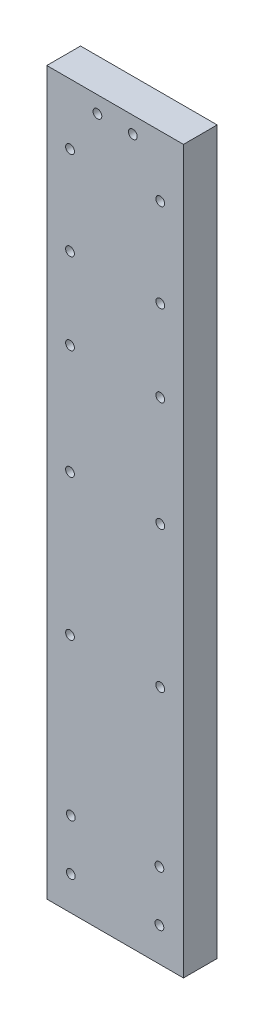
ISO-10303-21;
HEADER;
FILE_DESCRIPTION(('STEP AP214'),'2;1');
FILE_NAME('part.step','',(''),(''),'','','');
FILE_SCHEMA(('AUTOMOTIVE_DESIGN { 1 0 10303 214 1 1 1 1 }'));
ENDSEC;
DATA;
#1=APPLICATION_CONTEXT('core data for automotive mechanical design processes');
#2=APPLICATION_PROTOCOL_DEFINITION('international standard','automotive_design',2000,#1);
#3=PRODUCT_CONTEXT('',#1,'mechanical');
#4=PRODUCT('Part','Part','',(#3));
#5=PRODUCT_RELATED_PRODUCT_CATEGORY('part','',(#4));
#6=PRODUCT_DEFINITION_FORMATION('','',#4);
#7=PRODUCT_DEFINITION_CONTEXT('part definition',#1,'design');
#8=PRODUCT_DEFINITION('design','',#6,#7);
#9=PRODUCT_DEFINITION_SHAPE('','',#8);
#10=(LENGTH_UNIT() NAMED_UNIT(*) SI_UNIT(.MILLI.,.METRE.));
#11=(NAMED_UNIT(*) PLANE_ANGLE_UNIT() SI_UNIT($,.RADIAN.));
#12=(NAMED_UNIT(*) SI_UNIT($,.STERADIAN.) SOLID_ANGLE_UNIT());
#13=UNCERTAINTY_MEASURE_WITH_UNIT(LENGTH_MEASURE(1.E-05),#10,'distance_accuracy_value','');
#14=(GEOMETRIC_REPRESENTATION_CONTEXT(3) GLOBAL_UNCERTAINTY_ASSIGNED_CONTEXT((#13)) GLOBAL_UNIT_ASSIGNED_CONTEXT((#10,
#11,#12)) REPRESENTATION_CONTEXT('',''));
#15=CARTESIAN_POINT('',(0.,0.,0.));
#16=DIRECTION('',(0.,0.,1.));
#17=DIRECTION('',(1.,0.,0.));
#18=AXIS2_PLACEMENT_3D('',#15,#16,#17);
#19=CARTESIAN_POINT('',(0.,0.,4.));
#20=DIRECTION('',(0.,0.,-1.));
#21=DIRECTION('',(-1.,0.,0.));
#22=AXIS2_PLACEMENT_3D('',#19,#20,#21);
#23=PLANE('',#22);
#24=CARTESIAN_POINT('',(10.2,83.635,4.));
#25=DIRECTION('',(0.,0.,1.));
#26=DIRECTION('',(1.,0.,0.));
#27=AXIS2_PLACEMENT_3D('',#24,#25,#26);
#28=CIRCLE('',#27,0.519960121099865);
#29=CARTESIAN_POINT('',(10.7199601210999,83.635,4.));
#30=VERTEX_POINT('',#29);
#31=EDGE_CURVE('E193',#30,#30,#28,.T.);
#32=ORIENTED_EDGE('',*,*,#31,.F.);
#33=EDGE_LOOP('',(#32));
#34=FACE_BOUND('',#33,.T.);
#35=CARTESIAN_POINT('',(13.45,78.385,4.));
#36=DIRECTION('',(0.,0.,1.));
#37=DIRECTION('',(1.,0.,0.));
#38=AXIS2_PLACEMENT_3D('',#35,#36,#37);
#39=CIRCLE('',#38,0.519960121099861);
#40=CARTESIAN_POINT('',(13.9699601210999,78.385,4.));
#41=VERTEX_POINT('',#40);
#42=EDGE_CURVE('E181',#41,#41,#39,.T.);
#43=ORIENTED_EDGE('',*,*,#42,.F.);
#44=EDGE_LOOP('',(#43));
#45=FACE_BOUND('',#44,.T.);
#46=CARTESIAN_POINT('',(13.35,4.,4.));
#47=DIRECTION('',(0.,0.,1.));
#48=DIRECTION('',(-1.,0.,0.));
#49=AXIS2_PLACEMENT_3D('',#46,#47,#48);
#50=CIRCLE('',#49,0.519960121099866);
#51=CARTESIAN_POINT('',(12.8300398789001,4.,4.));
#52=VERTEX_POINT('',#51);
#53=EDGE_CURVE('E169',#52,#52,#50,.T.);
#54=ORIENTED_EDGE('',*,*,#53,.F.);
#55=EDGE_LOOP('',(#54));
#56=FACE_BOUND('',#55,.T.);
#57=CARTESIAN_POINT('',(2.85,4.,4.));
#58=DIRECTION('',(0.,0.,1.));
#59=DIRECTION('',(1.,0.,0.));
#60=AXIS2_PLACEMENT_3D('',#57,#58,#59);
#61=CIRCLE('',#60,0.519960121099866);
#62=CARTESIAN_POINT('',(3.36996012109987,4.,4.));
#63=VERTEX_POINT('',#62);
#64=EDGE_CURVE('E157',#63,#63,#61,.T.);
#65=ORIENTED_EDGE('',*,*,#64,.F.);
#66=EDGE_LOOP('',(#65));
#67=FACE_BOUND('',#66,.T.);
#68=CARTESIAN_POINT('',(13.45,67.885,4.));
#69=DIRECTION('',(0.,0.,1.));
#70=DIRECTION('',(1.,0.,0.));
#71=AXIS2_PLACEMENT_3D('',#68,#69,#70);
#72=CIRCLE('',#71,0.519960121099861);
#73=CARTESIAN_POINT('',(13.9699601210999,67.885,4.));
#74=VERTEX_POINT('',#73);
#75=EDGE_CURVE('E145',#74,#74,#72,.T.);
#76=ORIENTED_EDGE('',*,*,#75,.F.);
#77=EDGE_LOOP('',(#76));
#78=FACE_BOUND('',#77,.T.);
#79=CARTESIAN_POINT('',(13.45,58.24,4.));
#80=DIRECTION('',(0.,0.,1.));
#81=DIRECTION('',(1.,0.,0.));
#82=AXIS2_PLACEMENT_3D('',#79,#80,#81);
#83=CIRCLE('',#82,0.519960121099861);
#84=CARTESIAN_POINT('',(13.9699601210999,58.24,4.));
#85=VERTEX_POINT('',#84);
#86=EDGE_CURVE('E133',#85,#85,#83,.T.);
#87=ORIENTED_EDGE('',*,*,#86,.F.);
#88=EDGE_LOOP('',(#87));
#89=FACE_BOUND('',#88,.T.);
#90=CARTESIAN_POINT('',(13.45,45.24,4.));
#91=DIRECTION('',(0.,0.,1.));
#92=DIRECTION('',(1.,0.,0.));
#93=AXIS2_PLACEMENT_3D('',#90,#91,#92);
#94=CIRCLE('',#93,0.519960121099861);
#95=CARTESIAN_POINT('',(13.9699601210999,45.24,4.));
#96=VERTEX_POINT('',#95);
#97=EDGE_CURVE('E121',#96,#96,#94,.T.);
#98=ORIENTED_EDGE('',*,*,#97,.F.);
#99=EDGE_LOOP('',(#98));
#100=FACE_BOUND('',#99,.T.);
#101=CARTESIAN_POINT('',(13.45,28.5,4.));
#102=DIRECTION('',(0.,0.,1.));
#103=DIRECTION('',(1.,0.,0.));
#104=AXIS2_PLACEMENT_3D('',#101,#102,#103);
#105=CIRCLE('',#104,0.519960121099865);
#106=CARTESIAN_POINT('',(13.9699601210999,28.5,4.));
#107=VERTEX_POINT('',#106);
#108=EDGE_CURVE('E100',#107,#107,#105,.T.);
#109=ORIENTED_EDGE('',*,*,#108,.F.);
#110=EDGE_LOOP('',(#109));
#111=FACE_BOUND('',#110,.T.);
#112=DIRECTION('',(-1.,0.,0.));
#113=VECTOR('',#112,1.);
#114=CARTESIAN_POINT('',(16.2,85.59,4.));
#115=LINE('',#114,#113);
#116=CARTESIAN_POINT('',(16.2,85.59,4.));
#117=VERTEX_POINT('',#116);
#118=CARTESIAN_POINT('',(0.,85.59,4.));
#119=VERTEX_POINT('',#118);
#120=EDGE_CURVE('E85',#117,#119,#115,.T.);
#121=ORIENTED_EDGE('',*,*,#120,.T.);
#122=DIRECTION('',(0.,-1.,0.));
#123=VECTOR('',#122,1.);
#124=CARTESIAN_POINT('',(0.,0.,4.));
#125=LINE('',#124,#123);
#126=CARTESIAN_POINT('',(0.,0.,4.));
#127=VERTEX_POINT('',#126);
#128=EDGE_CURVE('E80',#119,#127,#125,.T.);
#129=ORIENTED_EDGE('',*,*,#128,.T.);
#130=DIRECTION('',(1.,0.,0.));
#131=VECTOR('',#130,1.);
#132=CARTESIAN_POINT('',(0.,0.,4.));
#133=LINE('',#132,#131);
#134=CARTESIAN_POINT('',(16.2,0.,4.));
#135=VERTEX_POINT('',#134);
#136=EDGE_CURVE('E83',#127,#135,#133,.T.);
#137=ORIENTED_EDGE('',*,*,#136,.T.);
#138=DIRECTION('',(0.,1.,0.));
#139=VECTOR('',#138,1.);
#140=CARTESIAN_POINT('',(16.2,0.,4.));
#141=LINE('',#140,#139);
#142=EDGE_CURVE('E50',#135,#117,#141,.T.);
#143=ORIENTED_EDGE('',*,*,#142,.T.);
#144=EDGE_LOOP('',(#121,#129,#137,#143));
#145=FACE_BOUND('',#144,.T.);
#146=CARTESIAN_POINT('',(2.75,28.5,4.));
#147=DIRECTION('',(0.,0.,1.));
#148=DIRECTION('',(1.,0.,0.));
#149=AXIS2_PLACEMENT_3D('',#146,#147,#148);
#150=CIRCLE('',#149,0.519960121099867);
#151=CARTESIAN_POINT('',(3.26996012109987,28.5,4.));
#152=VERTEX_POINT('',#151);
#153=EDGE_CURVE('E115',#152,#152,#150,.T.);
#154=ORIENTED_EDGE('',*,*,#153,.F.);
#155=EDGE_LOOP('',(#154));
#156=FACE_BOUND('',#155,.T.);
#157=CARTESIAN_POINT('',(2.75,45.24,4.));
#158=DIRECTION('',(0.,0.,1.));
#159=DIRECTION('',(1.,0.,0.));
#160=AXIS2_PLACEMENT_3D('',#157,#158,#159);
#161=CIRCLE('',#160,0.519960121099859);
#162=CARTESIAN_POINT('',(3.26996012109986,45.24,4.));
#163=VERTEX_POINT('',#162);
#164=EDGE_CURVE('E127',#163,#163,#161,.T.);
#165=ORIENTED_EDGE('',*,*,#164,.F.);
#166=EDGE_LOOP('',(#165));
#167=FACE_BOUND('',#166,.T.);
#168=CARTESIAN_POINT('',(2.75,58.24,4.));
#169=DIRECTION('',(0.,0.,1.));
#170=DIRECTION('',(1.,0.,0.));
#171=AXIS2_PLACEMENT_3D('',#168,#169,#170);
#172=CIRCLE('',#171,0.51996012109986);
#173=CARTESIAN_POINT('',(3.26996012109986,58.24,4.));
#174=VERTEX_POINT('',#173);
#175=EDGE_CURVE('E139',#174,#174,#172,.T.);
#176=ORIENTED_EDGE('',*,*,#175,.F.);
#177=EDGE_LOOP('',(#176));
#178=FACE_BOUND('',#177,.T.);
#179=CARTESIAN_POINT('',(2.85,10.,4.));
#180=DIRECTION('',(0.,0.,1.));
#181=DIRECTION('',(1.,0.,0.));
#182=AXIS2_PLACEMENT_3D('',#179,#180,#181);
#183=CIRCLE('',#182,0.519960121099866);
#184=CARTESIAN_POINT('',(3.36996012109986,10.,4.));
#185=VERTEX_POINT('',#184);
#186=EDGE_CURVE('E151',#185,#185,#183,.T.);
#187=ORIENTED_EDGE('',*,*,#186,.F.);
#188=EDGE_LOOP('',(#187));
#189=FACE_BOUND('',#188,.T.);
#190=CARTESIAN_POINT('',(13.3499999999999,10.,4.));
#191=DIRECTION('',(0.,0.,1.));
#192=DIRECTION('',(-1.,0.,0.));
#193=AXIS2_PLACEMENT_3D('',#190,#191,#192);
#194=CIRCLE('',#193,0.519960121099864);
#195=CARTESIAN_POINT('',(12.8300398789,10.,4.));
#196=VERTEX_POINT('',#195);
#197=EDGE_CURVE('E163',#196,#196,#194,.T.);
#198=ORIENTED_EDGE('',*,*,#197,.F.);
#199=EDGE_LOOP('',(#198));
#200=FACE_BOUND('',#199,.T.);
#201=CARTESIAN_POINT('',(2.74999999999862,67.885,4.));
#202=DIRECTION('',(0.,0.,1.));
#203=DIRECTION('',(1.,0.,0.));
#204=AXIS2_PLACEMENT_3D('',#201,#202,#203);
#205=CIRCLE('',#204,0.519960121099858);
#206=CARTESIAN_POINT('',(3.26996012109847,67.885,4.));
#207=VERTEX_POINT('',#206);
#208=EDGE_CURVE('E175',#207,#207,#205,.T.);
#209=ORIENTED_EDGE('',*,*,#208,.F.);
#210=EDGE_LOOP('',(#209));
#211=FACE_BOUND('',#210,.T.);
#212=CARTESIAN_POINT('',(2.74999999999862,78.385,4.));
#213=DIRECTION('',(0.,0.,1.));
#214=DIRECTION('',(1.,0.,0.));
#215=AXIS2_PLACEMENT_3D('',#212,#213,#214);
#216=CIRCLE('',#215,0.51996012109986);
#217=CARTESIAN_POINT('',(3.26996012109848,78.385,4.));
#218=VERTEX_POINT('',#217);
#219=EDGE_CURVE('E187',#218,#218,#216,.T.);
#220=ORIENTED_EDGE('',*,*,#219,.F.);
#221=EDGE_LOOP('',(#220));
#222=FACE_BOUND('',#221,.T.);
#223=CARTESIAN_POINT('',(6.,83.635,4.));
#224=DIRECTION('',(0.,0.,1.));
#225=DIRECTION('',(1.,0.,0.));
#226=AXIS2_PLACEMENT_3D('',#223,#224,#225);
#227=CIRCLE('',#226,0.519960121099862);
#228=CARTESIAN_POINT('',(6.51996012109986,83.635,4.));
#229=VERTEX_POINT('',#228);
#230=EDGE_CURVE('E199',#229,#229,#227,.T.);
#231=ORIENTED_EDGE('',*,*,#230,.F.);
#232=EDGE_LOOP('',(#231));
#233=FACE_BOUND('',#232,.T.);
#234=ADVANCED_FACE('F33',(#34,#45,#56,#67,#78,#89,#100,#111,#145,#156,#167,#178,#189,#200,#211,
#222,#233),#23,.F.);
#235=CARTESIAN_POINT('',(0.,0.,0.));
#236=DIRECTION('',(0.,0.,-1.));
#237=DIRECTION('',(-1.,0.,0.));
#238=AXIS2_PLACEMENT_3D('',#235,#236,#237);
#239=PLANE('',#238);
#240=CARTESIAN_POINT('',(10.2,83.635,0.));
#241=DIRECTION('',(0.,0.,1.));
#242=DIRECTION('',(1.,0.,0.));
#243=AXIS2_PLACEMENT_3D('',#240,#241,#242);
#244=CIRCLE('',#243,0.519960121099865);
#245=CARTESIAN_POINT('',(10.7199601210999,83.635,0.));
#246=VERTEX_POINT('',#245);
#247=EDGE_CURVE('E196',#246,#246,#244,.T.);
#248=ORIENTED_EDGE('',*,*,#247,.T.);
#249=EDGE_LOOP('',(#248));
#250=FACE_BOUND('',#249,.T.);
#251=CARTESIAN_POINT('',(13.45,78.385,0.));
#252=DIRECTION('',(0.,0.,1.));
#253=DIRECTION('',(1.,0.,0.));
#254=AXIS2_PLACEMENT_3D('',#251,#252,#253);
#255=CIRCLE('',#254,0.519960121099861);
#256=CARTESIAN_POINT('',(13.9699601210999,78.385,0.));
#257=VERTEX_POINT('',#256);
#258=EDGE_CURVE('E184',#257,#257,#255,.T.);
#259=ORIENTED_EDGE('',*,*,#258,.T.);
#260=EDGE_LOOP('',(#259));
#261=FACE_BOUND('',#260,.T.);
#262=CARTESIAN_POINT('',(13.35,4.,0.));
#263=DIRECTION('',(0.,0.,1.));
#264=DIRECTION('',(-1.,0.,0.));
#265=AXIS2_PLACEMENT_3D('',#262,#263,#264);
#266=CIRCLE('',#265,0.519960121099866);
#267=CARTESIAN_POINT('',(12.8300398789001,4.,0.));
#268=VERTEX_POINT('',#267);
#269=EDGE_CURVE('E172',#268,#268,#266,.T.);
#270=ORIENTED_EDGE('',*,*,#269,.T.);
#271=EDGE_LOOP('',(#270));
#272=FACE_BOUND('',#271,.T.);
#273=CARTESIAN_POINT('',(2.85,4.,0.));
#274=DIRECTION('',(0.,0.,1.));
#275=DIRECTION('',(1.,0.,0.));
#276=AXIS2_PLACEMENT_3D('',#273,#274,#275);
#277=CIRCLE('',#276,0.519960121099866);
#278=CARTESIAN_POINT('',(3.36996012109987,4.,0.));
#279=VERTEX_POINT('',#278);
#280=EDGE_CURVE('E160',#279,#279,#277,.T.);
#281=ORIENTED_EDGE('',*,*,#280,.T.);
#282=EDGE_LOOP('',(#281));
#283=FACE_BOUND('',#282,.T.);
#284=CARTESIAN_POINT('',(13.45,67.885,0.));
#285=DIRECTION('',(0.,0.,1.));
#286=DIRECTION('',(1.,0.,0.));
#287=AXIS2_PLACEMENT_3D('',#284,#285,#286);
#288=CIRCLE('',#287,0.519960121099861);
#289=CARTESIAN_POINT('',(13.9699601210999,67.885,0.));
#290=VERTEX_POINT('',#289);
#291=EDGE_CURVE('E148',#290,#290,#288,.T.);
#292=ORIENTED_EDGE('',*,*,#291,.T.);
#293=EDGE_LOOP('',(#292));
#294=FACE_BOUND('',#293,.T.);
#295=CARTESIAN_POINT('',(13.45,58.24,0.));
#296=DIRECTION('',(0.,0.,1.));
#297=DIRECTION('',(1.,0.,0.));
#298=AXIS2_PLACEMENT_3D('',#295,#296,#297);
#299=CIRCLE('',#298,0.519960121099861);
#300=CARTESIAN_POINT('',(13.9699601210999,58.24,0.));
#301=VERTEX_POINT('',#300);
#302=EDGE_CURVE('E136',#301,#301,#299,.T.);
#303=ORIENTED_EDGE('',*,*,#302,.T.);
#304=EDGE_LOOP('',(#303));
#305=FACE_BOUND('',#304,.T.);
#306=CARTESIAN_POINT('',(13.45,45.24,0.));
#307=DIRECTION('',(0.,0.,1.));
#308=DIRECTION('',(1.,0.,0.));
#309=AXIS2_PLACEMENT_3D('',#306,#307,#308);
#310=CIRCLE('',#309,0.519960121099861);
#311=CARTESIAN_POINT('',(13.9699601210999,45.24,0.));
#312=VERTEX_POINT('',#311);
#313=EDGE_CURVE('E124',#312,#312,#310,.T.);
#314=ORIENTED_EDGE('',*,*,#313,.T.);
#315=EDGE_LOOP('',(#314));
#316=FACE_BOUND('',#315,.T.);
#317=CARTESIAN_POINT('',(13.45,28.5,0.));
#318=DIRECTION('',(0.,0.,1.));
#319=DIRECTION('',(1.,0.,0.));
#320=AXIS2_PLACEMENT_3D('',#317,#318,#319);
#321=CIRCLE('',#320,0.519960121099865);
#322=CARTESIAN_POINT('',(13.9699601210999,28.5,0.));
#323=VERTEX_POINT('',#322);
#324=EDGE_CURVE('E112',#323,#323,#321,.T.);
#325=ORIENTED_EDGE('',*,*,#324,.T.);
#326=EDGE_LOOP('',(#325));
#327=FACE_BOUND('',#326,.T.);
#328=DIRECTION('',(-1.,0.,0.));
#329=VECTOR('',#328,1.);
#330=CARTESIAN_POINT('',(16.2,85.59,0.));
#331=LINE('',#330,#329);
#332=CARTESIAN_POINT('',(16.2,85.59,0.));
#333=VERTEX_POINT('',#332);
#334=CARTESIAN_POINT('',(0.,85.59,0.));
#335=VERTEX_POINT('',#334);
#336=EDGE_CURVE('E97',#333,#335,#331,.T.);
#337=ORIENTED_EDGE('',*,*,#336,.F.);
#338=DIRECTION('',(0.,1.,0.));
#339=VECTOR('',#338,1.);
#340=CARTESIAN_POINT('',(16.2,0.,0.));
#341=LINE('',#340,#339);
#342=CARTESIAN_POINT('',(16.2,0.,0.));
#343=VERTEX_POINT('',#342);
#344=EDGE_CURVE('E73',#343,#333,#341,.T.);
#345=ORIENTED_EDGE('',*,*,#344,.F.);
#346=DIRECTION('',(1.,0.,0.));
#347=VECTOR('',#346,1.);
#348=CARTESIAN_POINT('',(0.,0.,0.));
#349=LINE('',#348,#347);
#350=CARTESIAN_POINT('',(0.,0.,0.));
#351=VERTEX_POINT('',#350);
#352=EDGE_CURVE('E67',#351,#343,#349,.T.);
#353=ORIENTED_EDGE('',*,*,#352,.F.);
#354=DIRECTION('',(0.,-1.,0.));
#355=VECTOR('',#354,1.);
#356=CARTESIAN_POINT('',(0.,0.,0.));
#357=LINE('',#356,#355);
#358=EDGE_CURVE('E89',#335,#351,#357,.T.);
#359=ORIENTED_EDGE('',*,*,#358,.F.);
#360=EDGE_LOOP('',(#337,#345,#353,#359));
#361=FACE_BOUND('',#360,.T.);
#362=CARTESIAN_POINT('',(2.75,28.5,0.));
#363=DIRECTION('',(0.,0.,1.));
#364=DIRECTION('',(1.,0.,0.));
#365=AXIS2_PLACEMENT_3D('',#362,#363,#364);
#366=CIRCLE('',#365,0.519960121099867);
#367=CARTESIAN_POINT('',(3.26996012109987,28.5,0.));
#368=VERTEX_POINT('',#367);
#369=EDGE_CURVE('E118',#368,#368,#366,.T.);
#370=ORIENTED_EDGE('',*,*,#369,.T.);
#371=EDGE_LOOP('',(#370));
#372=FACE_BOUND('',#371,.T.);
#373=CARTESIAN_POINT('',(2.75,45.24,0.));
#374=DIRECTION('',(0.,0.,1.));
#375=DIRECTION('',(1.,0.,0.));
#376=AXIS2_PLACEMENT_3D('',#373,#374,#375);
#377=CIRCLE('',#376,0.519960121099859);
#378=CARTESIAN_POINT('',(3.26996012109986,45.24,0.));
#379=VERTEX_POINT('',#378);
#380=EDGE_CURVE('E130',#379,#379,#377,.T.);
#381=ORIENTED_EDGE('',*,*,#380,.T.);
#382=EDGE_LOOP('',(#381));
#383=FACE_BOUND('',#382,.T.);
#384=CARTESIAN_POINT('',(2.75,58.24,0.));
#385=DIRECTION('',(0.,0.,1.));
#386=DIRECTION('',(1.,0.,0.));
#387=AXIS2_PLACEMENT_3D('',#384,#385,#386);
#388=CIRCLE('',#387,0.51996012109986);
#389=CARTESIAN_POINT('',(3.26996012109986,58.24,0.));
#390=VERTEX_POINT('',#389);
#391=EDGE_CURVE('E142',#390,#390,#388,.T.);
#392=ORIENTED_EDGE('',*,*,#391,.T.);
#393=EDGE_LOOP('',(#392));
#394=FACE_BOUND('',#393,.T.);
#395=CARTESIAN_POINT('',(2.85,10.,0.));
#396=DIRECTION('',(0.,0.,1.));
#397=DIRECTION('',(1.,0.,0.));
#398=AXIS2_PLACEMENT_3D('',#395,#396,#397);
#399=CIRCLE('',#398,0.519960121099866);
#400=CARTESIAN_POINT('',(3.36996012109986,10.,0.));
#401=VERTEX_POINT('',#400);
#402=EDGE_CURVE('E154',#401,#401,#399,.T.);
#403=ORIENTED_EDGE('',*,*,#402,.T.);
#404=EDGE_LOOP('',(#403));
#405=FACE_BOUND('',#404,.T.);
#406=CARTESIAN_POINT('',(13.3499999999999,10.,0.));
#407=DIRECTION('',(0.,0.,1.));
#408=DIRECTION('',(-1.,0.,0.));
#409=AXIS2_PLACEMENT_3D('',#406,#407,#408);
#410=CIRCLE('',#409,0.519960121099864);
#411=CARTESIAN_POINT('',(12.8300398789,10.,0.));
#412=VERTEX_POINT('',#411);
#413=EDGE_CURVE('E166',#412,#412,#410,.T.);
#414=ORIENTED_EDGE('',*,*,#413,.T.);
#415=EDGE_LOOP('',(#414));
#416=FACE_BOUND('',#415,.T.);
#417=CARTESIAN_POINT('',(2.74999999999862,67.885,0.));
#418=DIRECTION('',(0.,0.,1.));
#419=DIRECTION('',(1.,0.,0.));
#420=AXIS2_PLACEMENT_3D('',#417,#418,#419);
#421=CIRCLE('',#420,0.519960121099858);
#422=CARTESIAN_POINT('',(3.26996012109847,67.885,0.));
#423=VERTEX_POINT('',#422);
#424=EDGE_CURVE('E178',#423,#423,#421,.T.);
#425=ORIENTED_EDGE('',*,*,#424,.T.);
#426=EDGE_LOOP('',(#425));
#427=FACE_BOUND('',#426,.T.);
#428=CARTESIAN_POINT('',(2.74999999999862,78.385,0.));
#429=DIRECTION('',(0.,0.,1.));
#430=DIRECTION('',(1.,0.,0.));
#431=AXIS2_PLACEMENT_3D('',#428,#429,#430);
#432=CIRCLE('',#431,0.51996012109986);
#433=CARTESIAN_POINT('',(3.26996012109848,78.385,0.));
#434=VERTEX_POINT('',#433);
#435=EDGE_CURVE('E190',#434,#434,#432,.T.);
#436=ORIENTED_EDGE('',*,*,#435,.T.);
#437=EDGE_LOOP('',(#436));
#438=FACE_BOUND('',#437,.T.);
#439=CARTESIAN_POINT('',(6.,83.635,0.));
#440=DIRECTION('',(0.,0.,1.));
#441=DIRECTION('',(1.,0.,0.));
#442=AXIS2_PLACEMENT_3D('',#439,#440,#441);
#443=CIRCLE('',#442,0.519960121099862);
#444=CARTESIAN_POINT('',(6.51996012109986,83.635,0.));
#445=VERTEX_POINT('',#444);
#446=EDGE_CURVE('E202',#445,#445,#443,.T.);
#447=ORIENTED_EDGE('',*,*,#446,.T.);
#448=EDGE_LOOP('',(#447));
#449=FACE_BOUND('',#448,.T.);
#450=ADVANCED_FACE('F108',(#250,#261,#272,#283,#294,#305,#316,#327,#361,#372,#383,#394,#405,
#416,#427,#438,#449),#239,.T.);
#451=CARTESIAN_POINT('',(16.2,85.59,4.));
#452=DIRECTION('',(0.,-1.,0.));
#453=DIRECTION('',(0.,0.,-1.));
#454=AXIS2_PLACEMENT_3D('',#451,#452,#453);
#455=PLANE('',#454);
#456=ORIENTED_EDGE('',*,*,#336,.T.);
#457=DIRECTION('',(0.,0.,-1.));
#458=VECTOR('',#457,1.);
#459=CARTESIAN_POINT('',(0.,85.59,4.));
#460=LINE('',#459,#458);
#461=EDGE_CURVE('E11',#119,#335,#460,.T.);
#462=ORIENTED_EDGE('',*,*,#461,.F.);
#463=ORIENTED_EDGE('',*,*,#120,.F.);
#464=DIRECTION('',(0.,0.,-1.));
#465=VECTOR('',#464,1.);
#466=CARTESIAN_POINT('',(16.2,85.59,4.));
#467=LINE('',#466,#465);
#468=EDGE_CURVE('E93',#117,#333,#467,.T.);
#469=ORIENTED_EDGE('',*,*,#468,.T.);
#470=EDGE_LOOP('',(#456,#462,#463,#469));
#471=FACE_BOUND('',#470,.T.);
#472=ADVANCED_FACE('F35',(#471),#455,.F.);
#473=CARTESIAN_POINT('',(0.,0.,4.));
#474=DIRECTION('',(1.,0.,0.));
#475=DIRECTION('',(0.,0.,-1.));
#476=AXIS2_PLACEMENT_3D('',#473,#474,#475);
#477=PLANE('',#476);
#478=ORIENTED_EDGE('',*,*,#358,.T.);
#479=DIRECTION('',(0.,0.,-1.));
#480=VECTOR('',#479,1.);
#481=CARTESIAN_POINT('',(0.,0.,4.));
#482=LINE('',#481,#480);
#483=EDGE_CURVE('E42',#127,#351,#482,.T.);
#484=ORIENTED_EDGE('',*,*,#483,.F.);
#485=ORIENTED_EDGE('',*,*,#128,.F.);
#486=ORIENTED_EDGE('',*,*,#461,.T.);
#487=EDGE_LOOP('',(#478,#484,#485,#486));
#488=FACE_BOUND('',#487,.T.);
#489=ADVANCED_FACE('F88',(#488),#477,.F.);
#490=CARTESIAN_POINT('',(0.,0.,4.));
#491=DIRECTION('',(0.,1.,0.));
#492=DIRECTION('',(0.,0.,1.));
#493=AXIS2_PLACEMENT_3D('',#490,#491,#492);
#494=PLANE('',#493);
#495=ORIENTED_EDGE('',*,*,#352,.T.);
#496=DIRECTION('',(0.,0.,-1.));
#497=VECTOR('',#496,1.);
#498=CARTESIAN_POINT('',(16.2,0.,4.));
#499=LINE('',#498,#497);
#500=EDGE_CURVE('E90',#135,#343,#499,.T.);
#501=ORIENTED_EDGE('',*,*,#500,.F.);
#502=ORIENTED_EDGE('',*,*,#136,.F.);
#503=ORIENTED_EDGE('',*,*,#483,.T.);
#504=EDGE_LOOP('',(#495,#501,#502,#503));
#505=FACE_BOUND('',#504,.T.);
#506=ADVANCED_FACE('F91',(#505),#494,.F.);
#507=CARTESIAN_POINT('',(16.2,0.,4.));
#508=DIRECTION('',(-1.,0.,0.));
#509=DIRECTION('',(0.,0.,1.));
#510=AXIS2_PLACEMENT_3D('',#507,#508,#509);
#511=PLANE('',#510);
#512=ORIENTED_EDGE('',*,*,#344,.T.);
#513=ORIENTED_EDGE('',*,*,#468,.F.);
#514=ORIENTED_EDGE('',*,*,#142,.F.);
#515=ORIENTED_EDGE('',*,*,#500,.T.);
#516=EDGE_LOOP('',(#512,#513,#514,#515));
#517=FACE_BOUND('',#516,.T.);
#518=ADVANCED_FACE('F105',(#517),#511,.F.);
#519=CARTESIAN_POINT('',(13.45,28.5,4.));
#520=DIRECTION('',(0.,0.,-1.));
#521=DIRECTION('',(-1.,0.,0.));
#522=AXIS2_PLACEMENT_3D('',#519,#520,#521);
#523=CYLINDRICAL_SURFACE('',#522,0.519960121099865);
#524=ORIENTED_EDGE('',*,*,#108,.T.);
#525=EDGE_LOOP('',(#524));
#526=FACE_BOUND('',#525,.T.);
#527=ORIENTED_EDGE('',*,*,#324,.F.);
#528=EDGE_LOOP('',(#527));
#529=FACE_BOUND('',#528,.T.);
#530=ADVANCED_FACE('F222',(#526,#529),#523,.F.);
#531=CARTESIAN_POINT('',(2.75,28.5,4.));
#532=DIRECTION('',(0.,0.,-1.));
#533=DIRECTION('',(-1.,0.,0.));
#534=AXIS2_PLACEMENT_3D('',#531,#532,#533);
#535=CYLINDRICAL_SURFACE('',#534,0.519960121099867);
#536=ORIENTED_EDGE('',*,*,#153,.T.);
#537=EDGE_LOOP('',(#536));
#538=FACE_BOUND('',#537,.T.);
#539=ORIENTED_EDGE('',*,*,#369,.F.);
#540=EDGE_LOOP('',(#539));
#541=FACE_BOUND('',#540,.T.);
#542=ADVANCED_FACE('F268',(#538,#541),#535,.F.);
#543=CARTESIAN_POINT('',(13.45,45.24,4.));
#544=DIRECTION('',(0.,0.,-1.));
#545=DIRECTION('',(-1.,0.,0.));
#546=AXIS2_PLACEMENT_3D('',#543,#544,#545);
#547=CYLINDRICAL_SURFACE('',#546,0.519960121099861);
#548=ORIENTED_EDGE('',*,*,#97,.T.);
#549=EDGE_LOOP('',(#548));
#550=FACE_BOUND('',#549,.T.);
#551=ORIENTED_EDGE('',*,*,#313,.F.);
#552=EDGE_LOOP('',(#551));
#553=FACE_BOUND('',#552,.T.);
#554=ADVANCED_FACE('F276',(#550,#553),#547,.F.);
#555=CARTESIAN_POINT('',(2.75,45.24,4.));
#556=DIRECTION('',(0.,0.,-1.));
#557=DIRECTION('',(-1.,0.,0.));
#558=AXIS2_PLACEMENT_3D('',#555,#556,#557);
#559=CYLINDRICAL_SURFACE('',#558,0.519960121099859);
#560=ORIENTED_EDGE('',*,*,#164,.T.);
#561=EDGE_LOOP('',(#560));
#562=FACE_BOUND('',#561,.T.);
#563=ORIENTED_EDGE('',*,*,#380,.F.);
#564=EDGE_LOOP('',(#563));
#565=FACE_BOUND('',#564,.T.);
#566=ADVANCED_FACE('F284',(#562,#565),#559,.F.);
#567=CARTESIAN_POINT('',(13.45,58.24,4.));
#568=DIRECTION('',(0.,0.,-1.));
#569=DIRECTION('',(-1.,0.,0.));
#570=AXIS2_PLACEMENT_3D('',#567,#568,#569);
#571=CYLINDRICAL_SURFACE('',#570,0.519960121099861);
#572=ORIENTED_EDGE('',*,*,#86,.T.);
#573=EDGE_LOOP('',(#572));
#574=FACE_BOUND('',#573,.T.);
#575=ORIENTED_EDGE('',*,*,#302,.F.);
#576=EDGE_LOOP('',(#575));
#577=FACE_BOUND('',#576,.T.);
#578=ADVANCED_FACE('F293',(#574,#577),#571,.F.);
#579=CARTESIAN_POINT('',(2.75,58.24,4.));
#580=DIRECTION('',(0.,0.,-1.));
#581=DIRECTION('',(-1.,0.,0.));
#582=AXIS2_PLACEMENT_3D('',#579,#580,#581);
#583=CYLINDRICAL_SURFACE('',#582,0.51996012109986);
#584=ORIENTED_EDGE('',*,*,#175,.T.);
#585=EDGE_LOOP('',(#584));
#586=FACE_BOUND('',#585,.T.);
#587=ORIENTED_EDGE('',*,*,#391,.F.);
#588=EDGE_LOOP('',(#587));
#589=FACE_BOUND('',#588,.T.);
#590=ADVANCED_FACE('F302',(#586,#589),#583,.F.);
#591=CARTESIAN_POINT('',(13.45,67.885,4.));
#592=DIRECTION('',(0.,0.,-1.));
#593=DIRECTION('',(-1.,0.,0.));
#594=AXIS2_PLACEMENT_3D('',#591,#592,#593);
#595=CYLINDRICAL_SURFACE('',#594,0.519960121099861);
#596=ORIENTED_EDGE('',*,*,#75,.T.);
#597=EDGE_LOOP('',(#596));
#598=FACE_BOUND('',#597,.T.);
#599=ORIENTED_EDGE('',*,*,#291,.F.);
#600=EDGE_LOOP('',(#599));
#601=FACE_BOUND('',#600,.T.);
#602=ADVANCED_FACE('F311',(#598,#601),#595,.F.);
#603=CARTESIAN_POINT('',(2.85,10.,4.));
#604=DIRECTION('',(0.,0.,-1.));
#605=DIRECTION('',(-1.,0.,0.));
#606=AXIS2_PLACEMENT_3D('',#603,#604,#605);
#607=CYLINDRICAL_SURFACE('',#606,0.519960121099866);
#608=ORIENTED_EDGE('',*,*,#186,.T.);
#609=EDGE_LOOP('',(#608));
#610=FACE_BOUND('',#609,.T.);
#611=ORIENTED_EDGE('',*,*,#402,.F.);
#612=EDGE_LOOP('',(#611));
#613=FACE_BOUND('',#612,.T.);
#614=ADVANCED_FACE('F320',(#610,#613),#607,.F.);
#615=CARTESIAN_POINT('',(2.85,4.,4.));
#616=DIRECTION('',(0.,0.,-1.));
#617=DIRECTION('',(-1.,0.,0.));
#618=AXIS2_PLACEMENT_3D('',#615,#616,#617);
#619=CYLINDRICAL_SURFACE('',#618,0.519960121099866);
#620=ORIENTED_EDGE('',*,*,#64,.T.);
#621=EDGE_LOOP('',(#620));
#622=FACE_BOUND('',#621,.T.);
#623=ORIENTED_EDGE('',*,*,#280,.F.);
#624=EDGE_LOOP('',(#623));
#625=FACE_BOUND('',#624,.T.);
#626=ADVANCED_FACE('F329',(#622,#625),#619,.F.);
#627=CARTESIAN_POINT('',(13.3499999999999,10.,4.));
#628=DIRECTION('',(0.,0.,-1.));
#629=DIRECTION('',(-1.,0.,0.));
#630=AXIS2_PLACEMENT_3D('',#627,#628,#629);
#631=CYLINDRICAL_SURFACE('',#630,0.519960121099864);
#632=ORIENTED_EDGE('',*,*,#197,.T.);
#633=EDGE_LOOP('',(#632));
#634=FACE_BOUND('',#633,.T.);
#635=ORIENTED_EDGE('',*,*,#413,.F.);
#636=EDGE_LOOP('',(#635));
#637=FACE_BOUND('',#636,.T.);
#638=ADVANCED_FACE('F338',(#634,#637),#631,.F.);
#639=CARTESIAN_POINT('',(13.35,4.,4.));
#640=DIRECTION('',(0.,0.,-1.));
#641=DIRECTION('',(-1.,0.,0.));
#642=AXIS2_PLACEMENT_3D('',#639,#640,#641);
#643=CYLINDRICAL_SURFACE('',#642,0.519960121099866);
#644=ORIENTED_EDGE('',*,*,#53,.T.);
#645=EDGE_LOOP('',(#644));
#646=FACE_BOUND('',#645,.T.);
#647=ORIENTED_EDGE('',*,*,#269,.F.);
#648=EDGE_LOOP('',(#647));
#649=FACE_BOUND('',#648,.T.);
#650=ADVANCED_FACE('F347',(#646,#649),#643,.F.);
#651=CARTESIAN_POINT('',(2.74999999999862,67.885,4.));
#652=DIRECTION('',(0.,0.,-1.));
#653=DIRECTION('',(-1.,0.,0.));
#654=AXIS2_PLACEMENT_3D('',#651,#652,#653);
#655=CYLINDRICAL_SURFACE('',#654,0.519960121099858);
#656=ORIENTED_EDGE('',*,*,#208,.T.);
#657=EDGE_LOOP('',(#656));
#658=FACE_BOUND('',#657,.T.);
#659=ORIENTED_EDGE('',*,*,#424,.F.);
#660=EDGE_LOOP('',(#659));
#661=FACE_BOUND('',#660,.T.);
#662=ADVANCED_FACE('F356',(#658,#661),#655,.F.);
#663=CARTESIAN_POINT('',(13.45,78.385,4.));
#664=DIRECTION('',(0.,0.,-1.));
#665=DIRECTION('',(-1.,0.,0.));
#666=AXIS2_PLACEMENT_3D('',#663,#664,#665);
#667=CYLINDRICAL_SURFACE('',#666,0.519960121099861);
#668=ORIENTED_EDGE('',*,*,#42,.T.);
#669=EDGE_LOOP('',(#668));
#670=FACE_BOUND('',#669,.T.);
#671=ORIENTED_EDGE('',*,*,#258,.F.);
#672=EDGE_LOOP('',(#671));
#673=FACE_BOUND('',#672,.T.);
#674=ADVANCED_FACE('F365',(#670,#673),#667,.F.);
#675=CARTESIAN_POINT('',(2.74999999999862,78.385,4.));
#676=DIRECTION('',(0.,0.,-1.));
#677=DIRECTION('',(-1.,0.,0.));
#678=AXIS2_PLACEMENT_3D('',#675,#676,#677);
#679=CYLINDRICAL_SURFACE('',#678,0.51996012109986);
#680=ORIENTED_EDGE('',*,*,#219,.T.);
#681=EDGE_LOOP('',(#680));
#682=FACE_BOUND('',#681,.T.);
#683=ORIENTED_EDGE('',*,*,#435,.F.);
#684=EDGE_LOOP('',(#683));
#685=FACE_BOUND('',#684,.T.);
#686=ADVANCED_FACE('F374',(#682,#685),#679,.F.);
#687=CARTESIAN_POINT('',(10.2,83.635,4.));
#688=DIRECTION('',(0.,0.,-1.));
#689=DIRECTION('',(-1.,0.,0.));
#690=AXIS2_PLACEMENT_3D('',#687,#688,#689);
#691=CYLINDRICAL_SURFACE('',#690,0.519960121099865);
#692=ORIENTED_EDGE('',*,*,#31,.T.);
#693=EDGE_LOOP('',(#692));
#694=FACE_BOUND('',#693,.T.);
#695=ORIENTED_EDGE('',*,*,#247,.F.);
#696=EDGE_LOOP('',(#695));
#697=FACE_BOUND('',#696,.T.);
#698=ADVANCED_FACE('F383',(#694,#697),#691,.F.);
#699=CARTESIAN_POINT('',(6.,83.635,4.));
#700=DIRECTION('',(0.,0.,-1.));
#701=DIRECTION('',(-1.,0.,0.));
#702=AXIS2_PLACEMENT_3D('',#699,#700,#701);
#703=CYLINDRICAL_SURFACE('',#702,0.519960121099862);
#704=ORIENTED_EDGE('',*,*,#230,.T.);
#705=EDGE_LOOP('',(#704));
#706=FACE_BOUND('',#705,.T.);
#707=ORIENTED_EDGE('',*,*,#446,.F.);
#708=EDGE_LOOP('',(#707));
#709=FACE_BOUND('',#708,.T.);
#710=ADVANCED_FACE('F208',(#706,#709),#703,.F.);
#711=CLOSED_SHELL('',(#234,#450,#472,#489,#506,#518,#530,#542,#554,#566,#578,#590,#602,#614,
#626,#638,#650,#662,#674,#686,#698,#710));
#712=MANIFOLD_SOLID_BREP('B2',#711);
#713=ADVANCED_BREP_SHAPE_REPRESENTATION('',(#18,#712),#14);
#714=SHAPE_DEFINITION_REPRESENTATION(#9,#713);
ENDSEC;
END-ISO-10303-21;
